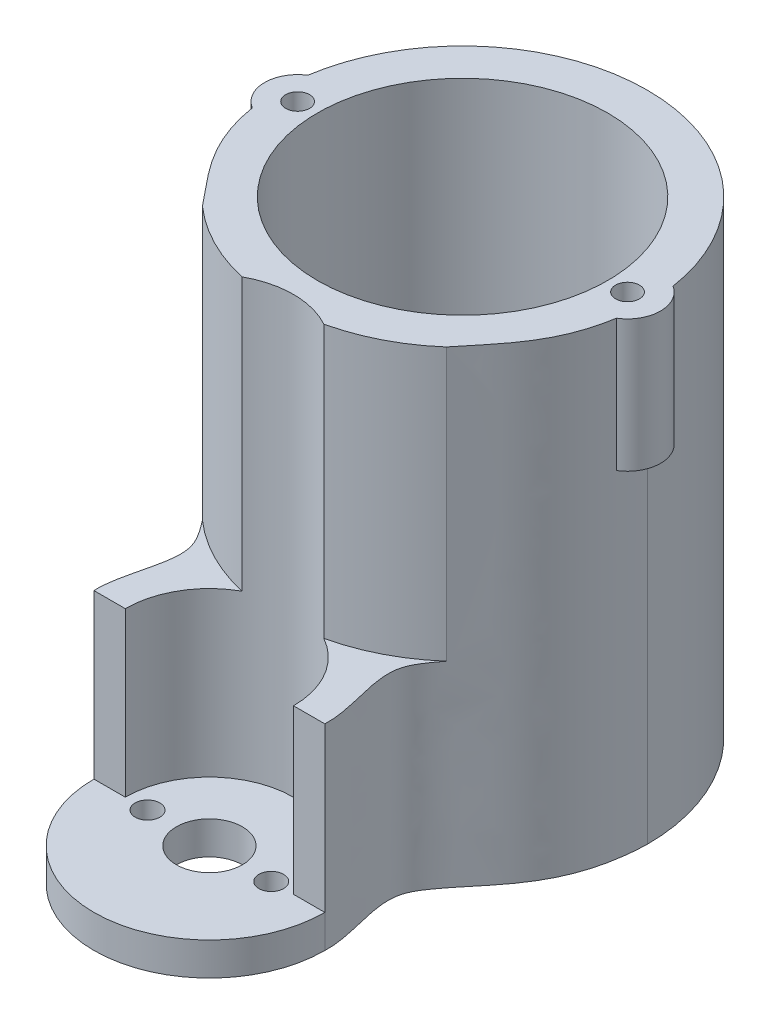
ISO-10303-21;
HEADER;
FILE_DESCRIPTION(('STEP AP214'),'2;1');
FILE_NAME('part.step','',(''),(''),'','','');
FILE_SCHEMA(('AUTOMOTIVE_DESIGN { 1 0 10303 214 1 1 1 1 }'));
ENDSEC;
DATA;
#1=APPLICATION_CONTEXT('core data for automotive mechanical design processes');
#2=APPLICATION_PROTOCOL_DEFINITION('international standard','automotive_design',2000,#1);
#3=PRODUCT_CONTEXT('',#1,'mechanical');
#4=PRODUCT('Part','Part','',(#3));
#5=PRODUCT_RELATED_PRODUCT_CATEGORY('part','',(#4));
#6=PRODUCT_DEFINITION_FORMATION('','',#4);
#7=PRODUCT_DEFINITION_CONTEXT('part definition',#1,'design');
#8=PRODUCT_DEFINITION('design','',#6,#7);
#9=PRODUCT_DEFINITION_SHAPE('','',#8);
#10=(LENGTH_UNIT() NAMED_UNIT(*) SI_UNIT(.MILLI.,.METRE.));
#11=(NAMED_UNIT(*) PLANE_ANGLE_UNIT() SI_UNIT($,.RADIAN.));
#12=(NAMED_UNIT(*) SI_UNIT($,.STERADIAN.) SOLID_ANGLE_UNIT());
#13=UNCERTAINTY_MEASURE_WITH_UNIT(LENGTH_MEASURE(1.E-05),#10,'distance_accuracy_value','');
#14=(GEOMETRIC_REPRESENTATION_CONTEXT(3) GLOBAL_UNCERTAINTY_ASSIGNED_CONTEXT((#13)) GLOBAL_UNIT_ASSIGNED_CONTEXT((#10,
#11,#12)) REPRESENTATION_CONTEXT('',''));
#15=CARTESIAN_POINT('',(0.,0.,0.));
#16=DIRECTION('',(0.,0.,1.));
#17=DIRECTION('',(1.,0.,0.));
#18=AXIS2_PLACEMENT_3D('',#15,#16,#17);
#19=CARTESIAN_POINT('',(-15.4733208432417,56.8,15.895048312881));
#20=DIRECTION('',(0.,-1.,0.));
#21=DIRECTION('',(0.,0.,-1.));
#22=AXIS2_PLACEMENT_3D('',#19,#20,#21);
#23=PLANE('',#22);
#24=CARTESIAN_POINT('',(-20.,56.8,0.));
#25=DIRECTION('',(0.,1.,0.));
#26=DIRECTION('',(0.,0.,1.));
#27=AXIS2_PLACEMENT_3D('',#24,#25,#26);
#28=CIRCLE('',#27,1.45);
#29=CARTESIAN_POINT('',(-20.,56.8,1.45));
#30=VERTEX_POINT('',#29);
#31=EDGE_CURVE('E541',#30,#30,#28,.T.);
#32=ORIENTED_EDGE('',*,*,#31,.F.);
#33=EDGE_LOOP('',(#32));
#34=FACE_BOUND('',#33,.T.);
#35=CARTESIAN_POINT('',(20.,56.8,0.));
#36=DIRECTION('',(0.,1.,0.));
#37=DIRECTION('',(0.,0.,1.));
#38=AXIS2_PLACEMENT_3D('',#35,#36,#37);
#39=CIRCLE('',#38,1.45);
#40=CARTESIAN_POINT('',(20.,56.8,1.45));
#41=VERTEX_POINT('',#40);
#42=EDGE_CURVE('E534',#41,#41,#39,.T.);
#43=ORIENTED_EDGE('',*,*,#42,.F.);
#44=EDGE_LOOP('',(#43));
#45=FACE_BOUND('',#44,.T.);
#46=CARTESIAN_POINT('',(-22.4,56.8,0.));
#47=CARTESIAN_POINT('',(-22.1079390073594,56.8,9.89049841627631));
#48=CARTESIAN_POINT('',(-16.2560409462662,56.8,13.947885016827));
#49=CARTESIAN_POINT('',(-11.3881204461561,56.8,21.9947729313143));
#50=CARTESIAN_POINT('',(-14.1535350857998,56.8,27.3395149280146));
#51=CARTESIAN_POINT('',(-14.,56.8,30.7));
#52=B_SPLINE_CURVE_WITH_KNOTS('',3,(#46,#47,#48,#49,#50,#51),.UNSPECIFIED.,.F.,.F.,(4,1,1,4),
(0.,0.589197798849924,0.689197798849924,1.),.UNSPECIFIED.);
#53=CARTESIAN_POINT('',(-22.0837602663934,56.8,3.41437302475875));
#54=VERTEX_POINT('',#53);
#55=CARTESIAN_POINT('',(-14.7895145198363,56.8,16.7517363554733));
#56=VERTEX_POINT('',#55);
#57=EDGE_CURVE('E178',#54,#56,#52,.T.);
#58=ORIENTED_EDGE('',*,*,#57,.T.);
#59=CARTESIAN_POINT('',(0.,56.8,0.));
#60=DIRECTION('',(0.,-1.,0.));
#61=DIRECTION('',(0.,0.,-1.));
#62=AXIS2_PLACEMENT_3D('',#59,#60,#61);
#63=CIRCLE('',#62,22.3461497948916);
#64=CARTESIAN_POINT('',(-4.96198065867475,56.8,21.7882803038393));
#65=VERTEX_POINT('',#64);
#66=EDGE_CURVE('E167',#65,#56,#63,.T.);
#67=ORIENTED_EDGE('',*,*,#66,.F.);
#68=CARTESIAN_POINT('',(0.,56.8,30.7));
#69=DIRECTION('',(0.,-1.,0.));
#70=DIRECTION('',(0.,0.,-1.));
#71=AXIS2_PLACEMENT_3D('',#68,#69,#70);
#72=CIRCLE('',#71,10.2);
#73=CARTESIAN_POINT('',(4.96198065867475,56.8,21.7882803038393));
#74=VERTEX_POINT('',#73);
#75=EDGE_CURVE('E165',#65,#74,#72,.T.);
#76=ORIENTED_EDGE('',*,*,#75,.T.);
#77=CARTESIAN_POINT('',(14.7895145198536,56.8,16.751736355458));
#78=VERTEX_POINT('',#77);
#79=EDGE_CURVE('E149',#78,#74,#63,.T.);
#80=ORIENTED_EDGE('',*,*,#79,.F.);
#81=CARTESIAN_POINT('',(14.,56.8,30.7));
#82=CARTESIAN_POINT('',(14.1535350857998,56.8,27.3395149280146));
#83=CARTESIAN_POINT('',(11.3881204461561,56.8,21.9947729313143));
#84=CARTESIAN_POINT('',(16.2560409462662,56.8,13.947885016827));
#85=CARTESIAN_POINT('',(22.1079390073594,56.8,9.8904984162763));
#86=CARTESIAN_POINT('',(22.4,56.8,0.));
#87=B_SPLINE_CURVE_WITH_KNOTS('',3,(#81,#82,#83,#84,#85,#86),.UNSPECIFIED.,.F.,.F.,(4,1,1,4),
(0.,0.310802201150076,0.410802201150076,1.),.UNSPECIFIED.);
#88=CARTESIAN_POINT('',(22.0837602663934,56.8,3.41437302475876));
#89=VERTEX_POINT('',#88);
#90=EDGE_CURVE('E161',#78,#89,#87,.T.);
#91=ORIENTED_EDGE('',*,*,#90,.T.);
#92=CARTESIAN_POINT('',(20.,56.8,0.));
#93=DIRECTION('',(0.,1.,0.));
#94=DIRECTION('',(0.,0.,-1.));
#95=AXIS2_PLACEMENT_3D('',#92,#93,#94);
#96=CIRCLE('',#95,4.);
#97=CARTESIAN_POINT('',(22.144,56.8,-3.37687192531787));
#98=VERTEX_POINT('',#97);
#99=EDGE_CURVE('E561',#89,#98,#96,.T.);
#100=ORIENTED_EDGE('',*,*,#99,.T.);
#101=CARTESIAN_POINT('',(0.,56.8,0.));
#102=DIRECTION('',(0.,1.,0.));
#103=DIRECTION('',(0.,0.,-1.));
#104=AXIS2_PLACEMENT_3D('',#101,#102,#103);
#105=CIRCLE('',#104,22.4);
#106=CARTESIAN_POINT('',(-22.144,56.8,-3.37687192531785));
#107=VERTEX_POINT('',#106);
#108=EDGE_CURVE('E173',#98,#107,#105,.T.);
#109=ORIENTED_EDGE('',*,*,#108,.T.);
#110=CARTESIAN_POINT('',(-20.,56.8,0.));
#111=DIRECTION('',(0.,1.,0.));
#112=DIRECTION('',(0.,0.,1.));
#113=AXIS2_PLACEMENT_3D('',#110,#111,#112);
#114=CIRCLE('',#113,3.99999999999999);
#115=EDGE_CURVE('E510',#107,#54,#114,.T.);
#116=ORIENTED_EDGE('',*,*,#115,.T.);
#117=EDGE_LOOP('',(#58,#67,#76,#80,#91,#100,#109,#116));
#118=FACE_BOUND('',#117,.T.);
#119=CARTESIAN_POINT('',(0.,56.8,0.));
#120=DIRECTION('',(0.,1.,0.));
#121=DIRECTION('',(0.,0.,1.));
#122=AXIS2_PLACEMENT_3D('',#119,#120,#121);
#123=CIRCLE('',#122,17.6);
#124=CARTESIAN_POINT('',(0.,56.8,17.6));
#125=VERTEX_POINT('',#124);
#126=EDGE_CURVE('E487',#125,#125,#123,.T.);
#127=ORIENTED_EDGE('',*,*,#126,.F.);
#128=EDGE_LOOP('',(#127));
#129=FACE_BOUND('',#128,.T.);
#130=ADVANCED_FACE('F37',(#34,#45,#118,#129),#23,.F.);
#131=CARTESIAN_POINT('',(-15.4733208432417,0.,15.895048312881));
#132=DIRECTION('',(0.,-1.,0.));
#133=DIRECTION('',(0.,0.,-1.));
#134=AXIS2_PLACEMENT_3D('',#131,#132,#133);
#135=PLANE('',#134);
#136=CARTESIAN_POINT('',(7.5,0.,30.7));
#137=DIRECTION('',(0.,-1.,0.));
#138=DIRECTION('',(0.,0.,-1.));
#139=AXIS2_PLACEMENT_3D('',#136,#137,#138);
#140=CIRCLE('',#139,1.5);
#141=CARTESIAN_POINT('',(7.5,0.,29.2));
#142=VERTEX_POINT('',#141);
#143=EDGE_CURVE('E574',#142,#142,#140,.T.);
#144=ORIENTED_EDGE('',*,*,#143,.F.);
#145=EDGE_LOOP('',(#144));
#146=FACE_BOUND('',#145,.T.);
#147=CARTESIAN_POINT('',(-7.5,0.,30.7));
#148=DIRECTION('',(0.,-1.,0.));
#149=DIRECTION('',(0.,0.,-1.));
#150=AXIS2_PLACEMENT_3D('',#147,#148,#149);
#151=CIRCLE('',#150,1.5);
#152=CARTESIAN_POINT('',(-7.5,0.,29.2));
#153=VERTEX_POINT('',#152);
#154=EDGE_CURVE('E575',#153,#153,#151,.T.);
#155=ORIENTED_EDGE('',*,*,#154,.F.);
#156=EDGE_LOOP('',(#155));
#157=FACE_BOUND('',#156,.T.);
#158=CARTESIAN_POINT('',(0.,0.,30.7));
#159=DIRECTION('',(0.,-1.,0.));
#160=DIRECTION('',(0.,0.,-1.));
#161=AXIS2_PLACEMENT_3D('',#158,#159,#160);
#162=CIRCLE('',#161,4.);
#163=CARTESIAN_POINT('',(0.,0.,26.7));
#164=VERTEX_POINT('',#163);
#165=EDGE_CURVE('E582',#164,#164,#162,.T.);
#166=ORIENTED_EDGE('',*,*,#165,.F.);
#167=EDGE_LOOP('',(#166));
#168=FACE_BOUND('',#167,.T.);
#169=CARTESIAN_POINT('',(14.,0.,30.7));
#170=CARTESIAN_POINT('',(14.1535350857998,0.,27.3395149280146));
#171=CARTESIAN_POINT('',(11.3881204461561,0.,21.9947729313143));
#172=CARTESIAN_POINT('',(16.2560409462662,0.,13.947885016827));
#173=CARTESIAN_POINT('',(22.1079390073594,0.,9.8904984162763));
#174=CARTESIAN_POINT('',(22.4,0.,0.));
#175=B_SPLINE_CURVE_WITH_KNOTS('',3,(#169,#170,#171,#172,#173,#174),.UNSPECIFIED.,.F.,.F.,(4,1,
1,4),(0.,0.310802201150076,0.410802201150076,1.),.UNSPECIFIED.);
#176=CARTESIAN_POINT('',(14.,0.,30.7));
#177=VERTEX_POINT('',#176);
#178=CARTESIAN_POINT('',(22.4,0.,0.));
#179=VERTEX_POINT('',#178);
#180=EDGE_CURVE('E476',#177,#179,#175,.T.);
#181=ORIENTED_EDGE('',*,*,#180,.F.);
#182=CARTESIAN_POINT('',(0.,0.,30.7));
#183=DIRECTION('',(0.,-1.,0.));
#184=DIRECTION('',(0.,0.,1.));
#185=AXIS2_PLACEMENT_3D('',#182,#183,#184);
#186=CIRCLE('',#185,14.);
#187=CARTESIAN_POINT('',(-14.,0.,30.7));
#188=VERTEX_POINT('',#187);
#189=EDGE_CURVE('E592',#177,#188,#186,.T.);
#190=ORIENTED_EDGE('',*,*,#189,.T.);
#191=CARTESIAN_POINT('',(-22.4,0.,0.));
#192=CARTESIAN_POINT('',(-22.1079390073594,0.,9.89049841627631));
#193=CARTESIAN_POINT('',(-16.2560409462662,0.,13.947885016827));
#194=CARTESIAN_POINT('',(-11.3881204461561,0.,21.9947729313143));
#195=CARTESIAN_POINT('',(-14.1535350857998,0.,27.3395149280146));
#196=CARTESIAN_POINT('',(-14.,0.,30.7));
#197=B_SPLINE_CURVE_WITH_KNOTS('',3,(#191,#192,#193,#194,#195,#196),.UNSPECIFIED.,.F.,.F.,(4,1,
1,4),(0.,0.589197798849924,0.689197798849924,1.),.UNSPECIFIED.);
#198=CARTESIAN_POINT('',(-22.4,0.,0.));
#199=VERTEX_POINT('',#198);
#200=EDGE_CURVE('E480',#199,#188,#197,.T.);
#201=ORIENTED_EDGE('',*,*,#200,.F.);
#202=CARTESIAN_POINT('',(0.,0.,0.));
#203=DIRECTION('',(0.,1.,0.));
#204=DIRECTION('',(0.,0.,-1.));
#205=AXIS2_PLACEMENT_3D('',#202,#203,#204);
#206=CIRCLE('',#205,22.4);
#207=EDGE_CURVE('E474',#179,#199,#206,.T.);
#208=ORIENTED_EDGE('',*,*,#207,.F.);
#209=EDGE_LOOP('',(#181,#190,#201,#208));
#210=FACE_BOUND('',#209,.T.);
#211=CARTESIAN_POINT('',(0.,0.,0.));
#212=DIRECTION('',(0.,1.,0.));
#213=DIRECTION('',(0.,0.,1.));
#214=AXIS2_PLACEMENT_3D('',#211,#212,#213);
#215=CIRCLE('',#214,17.6);
#216=CARTESIAN_POINT('',(0.,0.,17.6));
#217=VERTEX_POINT('',#216);
#218=EDGE_CURVE('E494',#217,#217,#215,.T.);
#219=ORIENTED_EDGE('',*,*,#218,.T.);
#220=EDGE_LOOP('',(#219));
#221=FACE_BOUND('',#220,.T.);
#222=ADVANCED_FACE('F206',(#146,#157,#168,#210,#221),#135,.T.);
#223=DIRECTION('',(0.,-1.,0.));
#224=VECTOR('',#223,1.);
#225=SURFACE_OF_LINEAR_EXTRUSION('',#52,#224);
#226=DIRECTION('',(0.,-1.,0.));
#227=VECTOR('',#226,1.);
#228=CARTESIAN_POINT('',(-22.0837602663934,56.8,3.41437302475875));
#229=LINE('',#228,#227);
#230=CARTESIAN_POINT('',(-22.0837602663934,40.8,3.41437302475875));
#231=VERTEX_POINT('',#230);
#232=EDGE_CURVE('E513',#54,#231,#229,.T.);
#233=ORIENTED_EDGE('',*,*,#232,.T.);
#234=CARTESIAN_POINT('',(-22.4,40.8,0.));
#235=CARTESIAN_POINT('',(-22.1079390073594,40.8,9.89049841627631));
#236=CARTESIAN_POINT('',(-16.2560409462662,40.8,13.947885016827));
#237=CARTESIAN_POINT('',(-11.3881204461561,40.8,21.9947729313143));
#238=CARTESIAN_POINT('',(-14.1535350857998,40.8,27.3395149280146));
#239=CARTESIAN_POINT('',(-14.,40.8,30.7));
#240=B_SPLINE_CURVE_WITH_KNOTS('',3,(#234,#235,#236,#237,#238,#239),.UNSPECIFIED.,.F.,.F.,(4,1,
1,4),(0.,0.589197798849924,0.689197798849924,1.),.UNSPECIFIED.);
#241=CARTESIAN_POINT('',(-22.4,40.8,0.));
#242=VERTEX_POINT('',#241);
#243=EDGE_CURVE('E552',#242,#231,#240,.T.);
#244=ORIENTED_EDGE('',*,*,#243,.F.);
#245=DIRECTION('',(0.,-1.,0.));
#246=VECTOR('',#245,1.);
#247=CARTESIAN_POINT('',(-22.4,56.8,0.));
#248=LINE('',#247,#246);
#249=EDGE_CURVE('E176',#242,#199,#248,.T.);
#250=ORIENTED_EDGE('',*,*,#249,.T.);
#251=ORIENTED_EDGE('',*,*,#200,.T.);
#252=DIRECTION('',(0.,-1.,0.));
#253=VECTOR('',#252,1.);
#254=CARTESIAN_POINT('',(-14.,4.,30.7));
#255=LINE('',#254,#253);
#256=CARTESIAN_POINT('',(-14.,4.,30.7));
#257=VERTEX_POINT('',#256);
#258=EDGE_CURVE('E599',#257,#188,#255,.T.);
#259=ORIENTED_EDGE('',*,*,#258,.F.);
#260=DIRECTION('',(0.,-1.,0.));
#261=VECTOR('',#260,1.);
#262=CARTESIAN_POINT('',(-14.,56.8,30.7));
#263=LINE('',#262,#261);
#264=CARTESIAN_POINT('',(-14.,23.8,30.7));
#265=VERTEX_POINT('',#264);
#266=EDGE_CURVE('E463',#265,#257,#263,.T.);
#267=ORIENTED_EDGE('',*,*,#266,.F.);
#268=CARTESIAN_POINT('',(-22.4,23.8,0.));
#269=CARTESIAN_POINT('',(-22.1079390073594,23.8,9.89049841627631));
#270=CARTESIAN_POINT('',(-16.2560409462662,23.8,13.947885016827));
#271=CARTESIAN_POINT('',(-11.3881204461561,23.8,21.9947729313143));
#272=CARTESIAN_POINT('',(-14.1535350857998,23.8,27.3395149280146));
#273=CARTESIAN_POINT('',(-14.,23.8,30.7));
#274=B_SPLINE_CURVE_WITH_KNOTS('',3,(#268,#269,#270,#271,#272,#273),.UNSPECIFIED.,.F.,.F.,(4,1,
1,4),(0.,0.589197798849924,0.689197798849924,1.),.UNSPECIFIED.);
#275=CARTESIAN_POINT('',(-14.7895145198363,23.8,16.7517363554733));
#276=VERTEX_POINT('',#275);
#277=EDGE_CURVE('E517',#265,#276,#274,.F.);
#278=ORIENTED_EDGE('',*,*,#277,.T.);
#279=DIRECTION('',(0.,-1.,0.));
#280=VECTOR('',#279,1.);
#281=CARTESIAN_POINT('',(-14.7895145198363,56.8,16.7517363554733));
#282=LINE('',#281,#280);
#283=EDGE_CURVE('E515',#276,#56,#282,.F.);
#284=ORIENTED_EDGE('',*,*,#283,.T.);
#285=ORIENTED_EDGE('',*,*,#57,.F.);
#286=EDGE_LOOP('',(#233,#244,#250,#251,#259,#267,#278,#284,#285));
#287=FACE_BOUND('',#286,.T.);
#288=ADVANCED_FACE('F39',(#287),#225,.F.);
#289=CARTESIAN_POINT('',(-14.,56.8,30.7));
#290=DIRECTION('',(0.,0.,-1.));
#291=DIRECTION('',(-1.,0.,0.));
#292=AXIS2_PLACEMENT_3D('',#289,#290,#291);
#293=PLANE('',#292);
#294=DIRECTION('',(0.,-1.,0.));
#295=VECTOR('',#294,1.);
#296=CARTESIAN_POINT('',(-10.2,56.8,30.7));
#297=LINE('',#296,#295);
#298=CARTESIAN_POINT('',(-10.2,23.8,30.7));
#299=VERTEX_POINT('',#298);
#300=CARTESIAN_POINT('',(-10.2,4.,30.7));
#301=VERTEX_POINT('',#300);
#302=EDGE_CURVE('E465',#299,#301,#297,.T.);
#303=ORIENTED_EDGE('',*,*,#302,.F.);
#304=DIRECTION('',(-1.,0.,0.));
#305=VECTOR('',#304,1.);
#306=CARTESIAN_POINT('',(-14.,23.8,30.7));
#307=LINE('',#306,#305);
#308=EDGE_CURVE('E55',#299,#265,#307,.T.);
#309=ORIENTED_EDGE('',*,*,#308,.T.);
#310=ORIENTED_EDGE('',*,*,#266,.T.);
#311=DIRECTION('',(1.,0.,0.));
#312=VECTOR('',#311,1.);
#313=CARTESIAN_POINT('',(-14.,4.,30.7));
#314=LINE('',#313,#312);
#315=EDGE_CURVE('E498',#257,#301,#314,.T.);
#316=ORIENTED_EDGE('',*,*,#315,.T.);
#317=EDGE_LOOP('',(#303,#309,#310,#316));
#318=FACE_BOUND('',#317,.T.);
#319=ADVANCED_FACE('F199',(#318),#293,.F.);
#320=CARTESIAN_POINT('',(0.,56.8,30.7));
#321=DIRECTION('',(0.,-1.,0.));
#322=DIRECTION('',(0.,0.,-1.));
#323=AXIS2_PLACEMENT_3D('',#320,#321,#322);
#324=CYLINDRICAL_SURFACE('',#323,10.2);
#325=ORIENTED_EDGE('',*,*,#75,.F.);
#326=DIRECTION('',(0.,1.,0.));
#327=VECTOR('',#326,1.);
#328=CARTESIAN_POINT('',(-4.96198065867474,40.3,21.7882803038393));
#329=LINE('',#328,#327);
#330=CARTESIAN_POINT('',(-4.96198065867475,23.8,21.7882803038393));
#331=VERTEX_POINT('',#330);
#332=EDGE_CURVE('E155',#65,#331,#329,.F.);
#333=ORIENTED_EDGE('',*,*,#332,.T.);
#334=CARTESIAN_POINT('',(0.,23.8,30.7));
#335=DIRECTION('',(0.,-1.,0.));
#336=DIRECTION('',(0.,0.,-1.));
#337=AXIS2_PLACEMENT_3D('',#334,#335,#336);
#338=CIRCLE('',#337,10.2);
#339=EDGE_CURVE('E529',#331,#299,#338,.F.);
#340=ORIENTED_EDGE('',*,*,#339,.T.);
#341=ORIENTED_EDGE('',*,*,#302,.T.);
#342=CARTESIAN_POINT('',(0.,4.,30.7));
#343=DIRECTION('',(0.,1.,0.));
#344=DIRECTION('',(0.,0.,1.));
#345=AXIS2_PLACEMENT_3D('',#342,#343,#344);
#346=CIRCLE('',#345,10.2);
#347=CARTESIAN_POINT('',(10.2,4.,30.7));
#348=VERTEX_POINT('',#347);
#349=EDGE_CURVE('E605',#301,#348,#346,.F.);
#350=ORIENTED_EDGE('',*,*,#349,.T.);
#351=DIRECTION('',(0.,-1.,0.));
#352=VECTOR('',#351,1.);
#353=CARTESIAN_POINT('',(10.2,56.8,30.7));
#354=LINE('',#353,#352);
#355=CARTESIAN_POINT('',(10.2,23.8,30.7));
#356=VERTEX_POINT('',#355);
#357=EDGE_CURVE('E467',#356,#348,#354,.T.);
#358=ORIENTED_EDGE('',*,*,#357,.F.);
#359=CARTESIAN_POINT('',(4.96198065867475,23.8,21.7882803038393));
#360=VERTEX_POINT('',#359);
#361=EDGE_CURVE('E522',#356,#360,#338,.F.);
#362=ORIENTED_EDGE('',*,*,#361,.T.);
#363=DIRECTION('',(0.,1.,0.));
#364=VECTOR('',#363,1.);
#365=CARTESIAN_POINT('',(4.96198065867474,40.3,21.7882803038393));
#366=LINE('',#365,#364);
#367=EDGE_CURVE('E520',#360,#74,#366,.T.);
#368=ORIENTED_EDGE('',*,*,#367,.T.);
#369=EDGE_LOOP('',(#325,#333,#340,#341,#350,#358,#362,#368));
#370=FACE_BOUND('',#369,.T.);
#371=ADVANCED_FACE('F196',(#370),#324,.F.);
#372=CARTESIAN_POINT('',(10.2,56.8,30.7));
#373=DIRECTION('',(0.,0.,-1.));
#374=DIRECTION('',(-1.,0.,0.));
#375=AXIS2_PLACEMENT_3D('',#372,#373,#374);
#376=PLANE('',#375);
#377=DIRECTION('',(0.,-1.,0.));
#378=VECTOR('',#377,1.);
#379=CARTESIAN_POINT('',(14.,56.8,30.7));
#380=LINE('',#379,#378);
#381=CARTESIAN_POINT('',(14.,23.8,30.7));
#382=VERTEX_POINT('',#381);
#383=CARTESIAN_POINT('',(14.,4.,30.7));
#384=VERTEX_POINT('',#383);
#385=EDGE_CURVE('E469',#382,#384,#380,.T.);
#386=ORIENTED_EDGE('',*,*,#385,.F.);
#387=DIRECTION('',(-1.,0.,0.));
#388=VECTOR('',#387,1.);
#389=CARTESIAN_POINT('',(10.2,23.8,30.7));
#390=LINE('',#389,#388);
#391=EDGE_CURVE('E63',#382,#356,#390,.T.);
#392=ORIENTED_EDGE('',*,*,#391,.T.);
#393=ORIENTED_EDGE('',*,*,#357,.T.);
#394=DIRECTION('',(1.,0.,0.));
#395=VECTOR('',#394,1.);
#396=CARTESIAN_POINT('',(10.2,4.,30.7));
#397=LINE('',#396,#395);
#398=EDGE_CURVE('E601',#348,#384,#397,.T.);
#399=ORIENTED_EDGE('',*,*,#398,.T.);
#400=EDGE_LOOP('',(#386,#392,#393,#399));
#401=FACE_BOUND('',#400,.T.);
#402=ADVANCED_FACE('F192',(#401),#376,.F.);
#403=DIRECTION('',(0.,-1.,0.));
#404=VECTOR('',#403,1.);
#405=SURFACE_OF_LINEAR_EXTRUSION('',#87,#404);
#406=ORIENTED_EDGE('',*,*,#90,.F.);
#407=DIRECTION('',(0.,-1.,0.));
#408=VECTOR('',#407,1.);
#409=CARTESIAN_POINT('',(14.7895145198362,56.8,16.7517363554734));
#410=LINE('',#409,#408);
#411=CARTESIAN_POINT('',(14.7895145198536,23.8,16.751736355458));
#412=VERTEX_POINT('',#411);
#413=EDGE_CURVE('E146',#78,#412,#410,.T.);
#414=ORIENTED_EDGE('',*,*,#413,.T.);
#415=CARTESIAN_POINT('',(14.,23.8,30.7));
#416=CARTESIAN_POINT('',(14.1535350857998,23.8,27.3395149280146));
#417=CARTESIAN_POINT('',(11.3881204461561,23.8,21.9947729313143));
#418=CARTESIAN_POINT('',(16.2560409462662,23.8,13.947885016827));
#419=CARTESIAN_POINT('',(22.1079390073594,23.8,9.8904984162763));
#420=CARTESIAN_POINT('',(22.4,23.8,0.));
#421=B_SPLINE_CURVE_WITH_KNOTS('',3,(#415,#416,#417,#418,#419,#420),.UNSPECIFIED.,.F.,.F.,(4,1,
1,4),(0.,0.310802201150076,0.410802201150076,1.),.UNSPECIFIED.);
#422=EDGE_CURVE('E11',#412,#382,#421,.F.);
#423=ORIENTED_EDGE('',*,*,#422,.T.);
#424=ORIENTED_EDGE('',*,*,#385,.T.);
#425=DIRECTION('',(0.,-1.,0.));
#426=VECTOR('',#425,1.);
#427=CARTESIAN_POINT('',(14.,4.,30.7));
#428=LINE('',#427,#426);
#429=EDGE_CURVE('E596',#384,#177,#428,.T.);
#430=ORIENTED_EDGE('',*,*,#429,.T.);
#431=ORIENTED_EDGE('',*,*,#180,.T.);
#432=DIRECTION('',(0.,-1.,0.));
#433=VECTOR('',#432,1.);
#434=CARTESIAN_POINT('',(22.4,56.8,0.));
#435=LINE('',#434,#433);
#436=CARTESIAN_POINT('',(22.4,40.8,0.));
#437=VERTEX_POINT('',#436);
#438=EDGE_CURVE('E471',#437,#179,#435,.T.);
#439=ORIENTED_EDGE('',*,*,#438,.F.);
#440=CARTESIAN_POINT('',(14.,40.8,30.7));
#441=CARTESIAN_POINT('',(14.1535350857998,40.8,27.3395149280146));
#442=CARTESIAN_POINT('',(11.3881204461561,40.8,21.9947729313143));
#443=CARTESIAN_POINT('',(16.2560409462662,40.8,13.947885016827));
#444=CARTESIAN_POINT('',(22.1079390073594,40.8,9.8904984162763));
#445=CARTESIAN_POINT('',(22.4,40.8,0.));
#446=B_SPLINE_CURVE_WITH_KNOTS('',3,(#440,#441,#442,#443,#444,#445),.UNSPECIFIED.,.F.,.F.,(4,1,
1,4),(0.,0.310802201150076,0.410802201150076,1.),.UNSPECIFIED.);
#447=CARTESIAN_POINT('',(22.0837602663934,40.8,3.41437302475876));
#448=VERTEX_POINT('',#447);
#449=EDGE_CURVE('E565',#437,#448,#446,.F.);
#450=ORIENTED_EDGE('',*,*,#449,.T.);
#451=DIRECTION('',(0.,-1.,0.));
#452=VECTOR('',#451,1.);
#453=CARTESIAN_POINT('',(22.0837602663934,56.8,3.41437302475876));
#454=LINE('',#453,#452);
#455=EDGE_CURVE('E172',#448,#89,#454,.F.);
#456=ORIENTED_EDGE('',*,*,#455,.T.);
#457=EDGE_LOOP('',(#406,#414,#423,#424,#430,#431,#439,#450,#456));
#458=FACE_BOUND('',#457,.T.);
#459=ADVANCED_FACE('F170',(#458),#405,.F.);
#460=CARTESIAN_POINT('',(0.,56.8,0.));
#461=DIRECTION('',(0.,-1.,0.));
#462=DIRECTION('',(0.,0.,-1.));
#463=AXIS2_PLACEMENT_3D('',#460,#461,#462);
#464=CYLINDRICAL_SURFACE('',#463,22.4);
#465=CARTESIAN_POINT('',(0.,40.8,0.));
#466=DIRECTION('',(0.,1.,0.));
#467=DIRECTION('',(0.,0.,1.));
#468=AXIS2_PLACEMENT_3D('',#465,#466,#467);
#469=CIRCLE('',#468,22.4);
#470=CARTESIAN_POINT('',(-22.144,40.8,-3.37687192531785));
#471=VERTEX_POINT('',#470);
#472=EDGE_CURVE('E450',#471,#242,#469,.T.);
#473=ORIENTED_EDGE('',*,*,#472,.F.);
#474=DIRECTION('',(0.,1.,0.));
#475=VECTOR('',#474,1.);
#476=CARTESIAN_POINT('',(-22.144,48.8,-3.37687192531785));
#477=LINE('',#476,#475);
#478=EDGE_CURVE('E48',#471,#107,#477,.T.);
#479=ORIENTED_EDGE('',*,*,#478,.T.);
#480=ORIENTED_EDGE('',*,*,#108,.F.);
#481=DIRECTION('',(0.,1.,0.));
#482=VECTOR('',#481,1.);
#483=CARTESIAN_POINT('',(22.144,48.8,-3.37687192531786));
#484=LINE('',#483,#482);
#485=CARTESIAN_POINT('',(22.144,40.8,-3.37687192531787));
#486=VERTEX_POINT('',#485);
#487=EDGE_CURVE('E455',#98,#486,#484,.F.);
#488=ORIENTED_EDGE('',*,*,#487,.T.);
#489=CARTESIAN_POINT('',(0.,40.8,0.));
#490=DIRECTION('',(0.,-1.,0.));
#491=DIRECTION('',(0.,0.,-1.));
#492=AXIS2_PLACEMENT_3D('',#489,#490,#491);
#493=CIRCLE('',#492,22.4);
#494=EDGE_CURVE('E458',#486,#437,#493,.T.);
#495=ORIENTED_EDGE('',*,*,#494,.T.);
#496=ORIENTED_EDGE('',*,*,#438,.T.);
#497=ORIENTED_EDGE('',*,*,#207,.T.);
#498=ORIENTED_EDGE('',*,*,#249,.F.);
#499=EDGE_LOOP('',(#473,#479,#480,#488,#495,#496,#497,#498));
#500=FACE_BOUND('',#499,.T.);
#501=ADVANCED_FACE('F191',(#500),#464,.T.);
#502=CARTESIAN_POINT('',(0.,56.8,0.));
#503=DIRECTION('',(0.,-1.,0.));
#504=DIRECTION('',(0.,0.,-1.));
#505=AXIS2_PLACEMENT_3D('',#502,#503,#504);
#506=CYLINDRICAL_SURFACE('',#505,17.6);
#507=ORIENTED_EDGE('',*,*,#126,.T.);
#508=EDGE_LOOP('',(#507));
#509=FACE_BOUND('',#508,.T.);
#510=ORIENTED_EDGE('',*,*,#218,.F.);
#511=EDGE_LOOP('',(#510));
#512=FACE_BOUND('',#511,.T.);
#513=ADVANCED_FACE('F219',(#509,#512),#506,.F.);
#514=CARTESIAN_POINT('',(-0.124754065927864,4.,19.2443602901473));
#515=DIRECTION('',(0.,1.,0.));
#516=DIRECTION('',(0.,0.,1.));
#517=AXIS2_PLACEMENT_3D('',#514,#515,#516);
#518=PLANE('',#517);
#519=CARTESIAN_POINT('',(7.5,4.,30.7));
#520=DIRECTION('',(0.,1.,0.));
#521=DIRECTION('',(0.,0.,1.));
#522=AXIS2_PLACEMENT_3D('',#519,#520,#521);
#523=CIRCLE('',#522,1.5);
#524=CARTESIAN_POINT('',(7.5,4.,32.2));
#525=VERTEX_POINT('',#524);
#526=EDGE_CURVE('E579',#525,#525,#523,.F.);
#527=ORIENTED_EDGE('',*,*,#526,.T.);
#528=EDGE_LOOP('',(#527));
#529=FACE_BOUND('',#528,.T.);
#530=CARTESIAN_POINT('',(-7.5,4.,30.7));
#531=DIRECTION('',(0.,1.,0.));
#532=DIRECTION('',(0.,0.,1.));
#533=AXIS2_PLACEMENT_3D('',#530,#531,#532);
#534=CIRCLE('',#533,1.5);
#535=CARTESIAN_POINT('',(-7.5,4.,32.2));
#536=VERTEX_POINT('',#535);
#537=EDGE_CURVE('E578',#536,#536,#534,.F.);
#538=ORIENTED_EDGE('',*,*,#537,.T.);
#539=EDGE_LOOP('',(#538));
#540=FACE_BOUND('',#539,.T.);
#541=CARTESIAN_POINT('',(0.,4.,30.7));
#542=DIRECTION('',(0.,1.,0.));
#543=DIRECTION('',(0.,0.,1.));
#544=AXIS2_PLACEMENT_3D('',#541,#542,#543);
#545=CIRCLE('',#544,4.);
#546=CARTESIAN_POINT('',(0.,4.,34.7));
#547=VERTEX_POINT('',#546);
#548=EDGE_CURVE('E589',#547,#547,#545,.F.);
#549=ORIENTED_EDGE('',*,*,#548,.T.);
#550=EDGE_LOOP('',(#549));
#551=FACE_BOUND('',#550,.T.);
#552=ORIENTED_EDGE('',*,*,#315,.F.);
#553=CARTESIAN_POINT('',(0.,4.,30.7));
#554=DIRECTION('',(0.,-1.,0.));
#555=DIRECTION('',(0.,0.,1.));
#556=AXIS2_PLACEMENT_3D('',#553,#554,#555);
#557=CIRCLE('',#556,14.);
#558=EDGE_CURVE('E593',#384,#257,#557,.T.);
#559=ORIENTED_EDGE('',*,*,#558,.F.);
#560=ORIENTED_EDGE('',*,*,#398,.F.);
#561=ORIENTED_EDGE('',*,*,#349,.F.);
#562=EDGE_LOOP('',(#552,#559,#560,#561));
#563=FACE_BOUND('',#562,.T.);
#564=ADVANCED_FACE('F222',(#529,#540,#551,#563),#518,.T.);
#565=CARTESIAN_POINT('',(0.,4.,30.7));
#566=DIRECTION('',(0.,-1.,0.));
#567=DIRECTION('',(0.,0.,-1.));
#568=AXIS2_PLACEMENT_3D('',#565,#566,#567);
#569=CYLINDRICAL_SURFACE('',#568,14.);
#570=ORIENTED_EDGE('',*,*,#189,.F.);
#571=ORIENTED_EDGE('',*,*,#429,.F.);
#572=ORIENTED_EDGE('',*,*,#558,.T.);
#573=ORIENTED_EDGE('',*,*,#258,.T.);
#574=EDGE_LOOP('',(#570,#571,#572,#573));
#575=FACE_BOUND('',#574,.T.);
#576=ADVANCED_FACE('F224',(#575),#569,.T.);
#577=CARTESIAN_POINT('',(0.,15.3137084989848,30.7));
#578=DIRECTION('',(0.,-1.,0.));
#579=DIRECTION('',(0.,0.,-1.));
#580=AXIS2_PLACEMENT_3D('',#577,#578,#579);
#581=CYLINDRICAL_SURFACE('',#580,4.);
#582=ORIENTED_EDGE('',*,*,#165,.T.);
#583=EDGE_LOOP('',(#582));
#584=FACE_BOUND('',#583,.T.);
#585=ORIENTED_EDGE('',*,*,#548,.F.);
#586=EDGE_LOOP('',(#585));
#587=FACE_BOUND('',#586,.T.);
#588=ADVANCED_FACE('F227',(#584,#587),#581,.F.);
#589=CARTESIAN_POINT('',(-7.5,15.3137084989848,30.7));
#590=DIRECTION('',(0.,-1.,0.));
#591=DIRECTION('',(0.,0.,-1.));
#592=AXIS2_PLACEMENT_3D('',#589,#590,#591);
#593=CYLINDRICAL_SURFACE('',#592,1.5);
#594=ORIENTED_EDGE('',*,*,#154,.T.);
#595=EDGE_LOOP('',(#594));
#596=FACE_BOUND('',#595,.T.);
#597=ORIENTED_EDGE('',*,*,#537,.F.);
#598=EDGE_LOOP('',(#597));
#599=FACE_BOUND('',#598,.T.);
#600=ADVANCED_FACE('F234',(#596,#599),#593,.F.);
#601=CARTESIAN_POINT('',(7.5,15.3137084989848,30.7));
#602=DIRECTION('',(0.,-1.,0.));
#603=DIRECTION('',(0.,0.,-1.));
#604=AXIS2_PLACEMENT_3D('',#601,#602,#603);
#605=CYLINDRICAL_SURFACE('',#604,1.5);
#606=ORIENTED_EDGE('',*,*,#143,.T.);
#607=EDGE_LOOP('',(#606));
#608=FACE_BOUND('',#607,.T.);
#609=ORIENTED_EDGE('',*,*,#526,.F.);
#610=EDGE_LOOP('',(#609));
#611=FACE_BOUND('',#610,.T.);
#612=ADVANCED_FACE('F236',(#608,#611),#605,.F.);
#613=CARTESIAN_POINT('',(20.,40.8,0.));
#614=DIRECTION('',(0.,1.,0.));
#615=DIRECTION('',(0.,0.,1.));
#616=AXIS2_PLACEMENT_3D('',#613,#614,#615);
#617=CYLINDRICAL_SURFACE('',#616,4.);
#618=ORIENTED_EDGE('',*,*,#455,.F.);
#619=CARTESIAN_POINT('',(20.,40.8,0.));
#620=DIRECTION('',(0.,1.,0.));
#621=DIRECTION('',(0.,0.,-1.));
#622=AXIS2_PLACEMENT_3D('',#619,#620,#621);
#623=CIRCLE('',#622,4.);
#624=EDGE_CURVE('E562',#448,#486,#623,.T.);
#625=ORIENTED_EDGE('',*,*,#624,.T.);
#626=ORIENTED_EDGE('',*,*,#487,.F.);
#627=ORIENTED_EDGE('',*,*,#99,.F.);
#628=EDGE_LOOP('',(#618,#625,#626,#627));
#629=FACE_BOUND('',#628,.T.);
#630=ADVANCED_FACE('F239',(#629),#617,.T.);
#631=CARTESIAN_POINT('',(20.,40.8,0.));
#632=DIRECTION('',(0.,-1.,0.));
#633=DIRECTION('',(0.,0.,-1.));
#634=AXIS2_PLACEMENT_3D('',#631,#632,#633);
#635=PLANE('',#634);
#636=ORIENTED_EDGE('',*,*,#449,.F.);
#637=ORIENTED_EDGE('',*,*,#494,.F.);
#638=ORIENTED_EDGE('',*,*,#624,.F.);
#639=EDGE_LOOP('',(#636,#637,#638));
#640=FACE_BOUND('',#639,.T.);
#641=ADVANCED_FACE('F246',(#640),#635,.T.);
#642=CARTESIAN_POINT('',(-20.,40.8,0.));
#643=DIRECTION('',(0.,1.,0.));
#644=DIRECTION('',(0.,0.,1.));
#645=AXIS2_PLACEMENT_3D('',#642,#643,#644);
#646=CYLINDRICAL_SURFACE('',#645,3.99999999999999);
#647=ORIENTED_EDGE('',*,*,#232,.F.);
#648=ORIENTED_EDGE('',*,*,#115,.F.);
#649=ORIENTED_EDGE('',*,*,#478,.F.);
#650=CARTESIAN_POINT('',(-20.,40.8,0.));
#651=DIRECTION('',(0.,1.,0.));
#652=DIRECTION('',(0.,0.,1.));
#653=AXIS2_PLACEMENT_3D('',#650,#651,#652);
#654=CIRCLE('',#653,3.99999999999999);
#655=EDGE_CURVE('E549',#471,#231,#654,.T.);
#656=ORIENTED_EDGE('',*,*,#655,.T.);
#657=EDGE_LOOP('',(#647,#648,#649,#656));
#658=FACE_BOUND('',#657,.T.);
#659=ADVANCED_FACE('F250',(#658),#646,.T.);
#660=CARTESIAN_POINT('',(-20.,40.8,0.));
#661=DIRECTION('',(0.,1.,0.));
#662=DIRECTION('',(0.,0.,1.));
#663=AXIS2_PLACEMENT_3D('',#660,#661,#662);
#664=PLANE('',#663);
#665=ORIENTED_EDGE('',*,*,#472,.T.);
#666=ORIENTED_EDGE('',*,*,#243,.T.);
#667=ORIENTED_EDGE('',*,*,#655,.F.);
#668=EDGE_LOOP('',(#665,#666,#667));
#669=FACE_BOUND('',#668,.T.);
#670=ADVANCED_FACE('F254',(#669),#664,.F.);
#671=CARTESIAN_POINT('',(20.,42.8,0.));
#672=DIRECTION('',(0.,1.,0.));
#673=DIRECTION('',(0.,0.,1.));
#674=AXIS2_PLACEMENT_3D('',#671,#672,#673);
#675=CYLINDRICAL_SURFACE('',#674,1.45);
#676=CARTESIAN_POINT('',(20.,42.8,0.));
#677=DIRECTION('',(0.,1.,0.));
#678=DIRECTION('',(0.,0.,1.));
#679=AXIS2_PLACEMENT_3D('',#676,#677,#678);
#680=CIRCLE('',#679,1.45);
#681=CARTESIAN_POINT('',(20.,42.8,1.45));
#682=VERTEX_POINT('',#681);
#683=EDGE_CURVE('E544',#682,#682,#680,.T.);
#684=ORIENTED_EDGE('',*,*,#683,.F.);
#685=EDGE_LOOP('',(#684));
#686=FACE_BOUND('',#685,.T.);
#687=ORIENTED_EDGE('',*,*,#42,.T.);
#688=EDGE_LOOP('',(#687));
#689=FACE_BOUND('',#688,.T.);
#690=ADVANCED_FACE('F258',(#686,#689),#675,.F.);
#691=CARTESIAN_POINT('',(20.,42.8,0.));
#692=DIRECTION('',(0.,1.,0.));
#693=DIRECTION('',(0.,0.,1.));
#694=AXIS2_PLACEMENT_3D('',#691,#692,#693);
#695=PLANE('',#694);
#696=ORIENTED_EDGE('',*,*,#683,.T.);
#697=EDGE_LOOP('',(#696));
#698=FACE_BOUND('',#697,.T.);
#699=ADVANCED_FACE('F262',(#698),#695,.T.);
#700=CARTESIAN_POINT('',(-20.,42.8,0.));
#701=DIRECTION('',(0.,1.,0.));
#702=DIRECTION('',(0.,0.,1.));
#703=AXIS2_PLACEMENT_3D('',#700,#701,#702);
#704=CYLINDRICAL_SURFACE('',#703,1.45);
#705=CARTESIAN_POINT('',(-20.,42.8,0.));
#706=DIRECTION('',(0.,1.,0.));
#707=DIRECTION('',(0.,0.,1.));
#708=AXIS2_PLACEMENT_3D('',#705,#706,#707);
#709=CIRCLE('',#708,1.45);
#710=CARTESIAN_POINT('',(-20.,42.8,1.45));
#711=VERTEX_POINT('',#710);
#712=EDGE_CURVE('E535',#711,#711,#709,.T.);
#713=ORIENTED_EDGE('',*,*,#712,.F.);
#714=EDGE_LOOP('',(#713));
#715=FACE_BOUND('',#714,.T.);
#716=ORIENTED_EDGE('',*,*,#31,.T.);
#717=EDGE_LOOP('',(#716));
#718=FACE_BOUND('',#717,.T.);
#719=ADVANCED_FACE('F266',(#715,#718),#704,.F.);
#720=CARTESIAN_POINT('',(-20.,42.8,0.));
#721=DIRECTION('',(0.,1.,0.));
#722=DIRECTION('',(0.,0.,1.));
#723=AXIS2_PLACEMENT_3D('',#720,#721,#722);
#724=PLANE('',#723);
#725=ORIENTED_EDGE('',*,*,#712,.T.);
#726=EDGE_LOOP('',(#725));
#727=FACE_BOUND('',#726,.T.);
#728=ADVANCED_FACE('F270',(#727),#724,.T.);
#729=CARTESIAN_POINT('',(0.,23.8,0.));
#730=DIRECTION('',(0.,-1.,0.));
#731=DIRECTION('',(0.,0.,-1.));
#732=AXIS2_PLACEMENT_3D('',#729,#730,#731);
#733=PLANE('',#732);
#734=ORIENTED_EDGE('',*,*,#391,.F.);
#735=ORIENTED_EDGE('',*,*,#422,.F.);
#736=CARTESIAN_POINT('',(0.,23.8,0.));
#737=DIRECTION('',(0.,-1.,0.));
#738=DIRECTION('',(0.,0.,-1.));
#739=AXIS2_PLACEMENT_3D('',#736,#737,#738);
#740=CIRCLE('',#739,22.3461497948916);
#741=EDGE_CURVE('E152',#412,#360,#740,.T.);
#742=ORIENTED_EDGE('',*,*,#741,.T.);
#743=ORIENTED_EDGE('',*,*,#361,.F.);
#744=EDGE_LOOP('',(#734,#735,#742,#743));
#745=FACE_BOUND('',#744,.T.);
#746=ADVANCED_FACE('F274',(#745),#733,.F.);
#747=CARTESIAN_POINT('',(0.,23.8,0.));
#748=DIRECTION('',(0.,1.,0.));
#749=DIRECTION('',(0.,0.,1.));
#750=AXIS2_PLACEMENT_3D('',#747,#748,#749);
#751=CYLINDRICAL_SURFACE('',#750,22.3461497948916);
#752=ORIENTED_EDGE('',*,*,#741,.F.);
#753=ORIENTED_EDGE('',*,*,#413,.F.);
#754=ORIENTED_EDGE('',*,*,#79,.T.);
#755=ORIENTED_EDGE('',*,*,#367,.F.);
#756=EDGE_LOOP('',(#752,#753,#754,#755));
#757=FACE_BOUND('',#756,.T.);
#758=ADVANCED_FACE('F148',(#757),#751,.T.);
#759=ORIENTED_EDGE('',*,*,#308,.F.);
#760=ORIENTED_EDGE('',*,*,#339,.F.);
#761=EDGE_CURVE('E166',#331,#276,#740,.T.);
#762=ORIENTED_EDGE('',*,*,#761,.T.);
#763=ORIENTED_EDGE('',*,*,#277,.F.);
#764=EDGE_LOOP('',(#759,#760,#762,#763));
#765=FACE_BOUND('',#764,.T.);
#766=ADVANCED_FACE('F279',(#765),#733,.F.);
#767=ORIENTED_EDGE('',*,*,#761,.F.);
#768=ORIENTED_EDGE('',*,*,#332,.F.);
#769=ORIENTED_EDGE('',*,*,#66,.T.);
#770=ORIENTED_EDGE('',*,*,#283,.F.);
#771=EDGE_LOOP('',(#767,#768,#769,#770));
#772=FACE_BOUND('',#771,.T.);
#773=ADVANCED_FACE('F276',(#772),#751,.T.);
#774=CLOSED_SHELL('',(#130,#222,#288,#319,#371,#402,#459,#501,#513,#564,#576,#588,#600,#612,
#630,#641,#659,#670,#690,#699,#719,#728,#746,#758,#766,#773));
#775=MANIFOLD_SOLID_BREP('B2',#774);
#776=ADVANCED_BREP_SHAPE_REPRESENTATION('',(#18,#775),#14);
#777=SHAPE_DEFINITION_REPRESENTATION(#9,#776);
ENDSEC;
END-ISO-10303-21;
